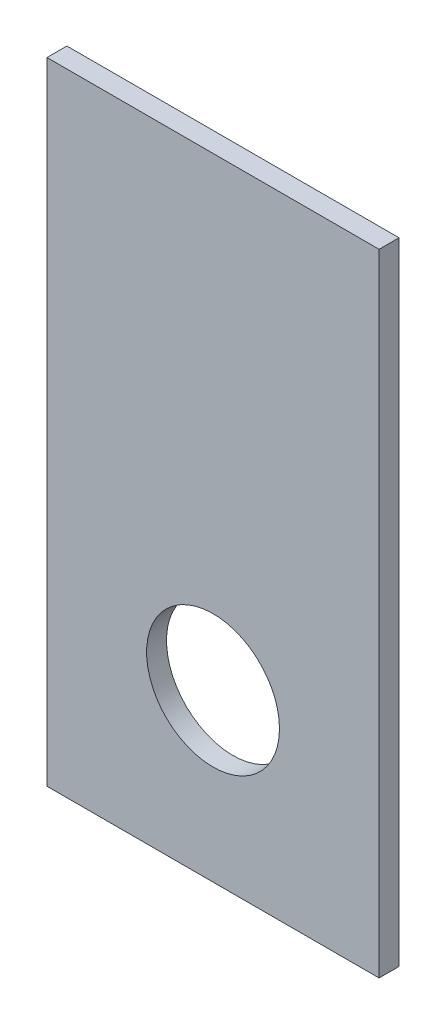
ISO-10303-21;
HEADER;
FILE_DESCRIPTION(('STEP AP214'),'2;1');
FILE_NAME('part.step','',(''),(''),'','','');
FILE_SCHEMA(('AUTOMOTIVE_DESIGN { 1 0 10303 214 1 1 1 1 }'));
ENDSEC;
DATA;
#1=APPLICATION_CONTEXT('core data for automotive mechanical design processes');
#2=APPLICATION_PROTOCOL_DEFINITION('international standard','automotive_design',2000,#1);
#3=PRODUCT_CONTEXT('',#1,'mechanical');
#4=PRODUCT('Part','Part','',(#3));
#5=PRODUCT_RELATED_PRODUCT_CATEGORY('part','',(#4));
#6=PRODUCT_DEFINITION_FORMATION('','',#4);
#7=PRODUCT_DEFINITION_CONTEXT('part definition',#1,'design');
#8=PRODUCT_DEFINITION('design','',#6,#7);
#9=PRODUCT_DEFINITION_SHAPE('','',#8);
#10=(LENGTH_UNIT() NAMED_UNIT(*) SI_UNIT(.MILLI.,.METRE.));
#11=(NAMED_UNIT(*) PLANE_ANGLE_UNIT() SI_UNIT($,.RADIAN.));
#12=(NAMED_UNIT(*) SI_UNIT($,.STERADIAN.) SOLID_ANGLE_UNIT());
#13=UNCERTAINTY_MEASURE_WITH_UNIT(LENGTH_MEASURE(1.E-05),#10,'distance_accuracy_value','');
#14=(GEOMETRIC_REPRESENTATION_CONTEXT(3) GLOBAL_UNCERTAINTY_ASSIGNED_CONTEXT((#13)) GLOBAL_UNIT_ASSIGNED_CONTEXT((#10,
#11,#12)) REPRESENTATION_CONTEXT('',''));
#15=CARTESIAN_POINT('',(0.,0.,0.));
#16=DIRECTION('',(0.,0.,1.));
#17=DIRECTION('',(1.,0.,0.));
#18=AXIS2_PLACEMENT_3D('',#15,#16,#17);
#19=CARTESIAN_POINT('',(0.,0.,3.));
#20=DIRECTION('',(0.,0.,1.));
#21=DIRECTION('',(1.,0.,0.));
#22=AXIS2_PLACEMENT_3D('',#19,#20,#21);
#23=PLANE('',#22);
#24=DIRECTION('',(0.,-1.,0.));
#25=VECTOR('',#24,1.);
#26=CARTESIAN_POINT('',(-25.,95.,3.));
#27=LINE('',#26,#25);
#28=CARTESIAN_POINT('',(-25.,95.,3.));
#29=VERTEX_POINT('',#28);
#30=CARTESIAN_POINT('',(-25.,0.,3.));
#31=VERTEX_POINT('',#30);
#32=EDGE_CURVE('E92',#29,#31,#27,.T.);
#33=ORIENTED_EDGE('',*,*,#32,.T.);
#34=DIRECTION('',(1.,0.,0.));
#35=VECTOR('',#34,1.);
#36=CARTESIAN_POINT('',(-25.,0.,3.));
#37=LINE('',#36,#35);
#38=CARTESIAN_POINT('',(25.,0.,3.));
#39=VERTEX_POINT('',#38);
#40=EDGE_CURVE('E87',#31,#39,#37,.T.);
#41=ORIENTED_EDGE('',*,*,#40,.T.);
#42=DIRECTION('',(0.,1.,0.));
#43=VECTOR('',#42,1.);
#44=CARTESIAN_POINT('',(25.,95.,3.));
#45=LINE('',#44,#43);
#46=CARTESIAN_POINT('',(25.,95.,3.));
#47=VERTEX_POINT('',#46);
#48=EDGE_CURVE('E90',#39,#47,#45,.T.);
#49=ORIENTED_EDGE('',*,*,#48,.T.);
#50=DIRECTION('',(-1.,0.,0.));
#51=VECTOR('',#50,1.);
#52=CARTESIAN_POINT('',(-25.,95.,3.));
#53=LINE('',#52,#51);
#54=EDGE_CURVE('E57',#47,#29,#53,.T.);
#55=ORIENTED_EDGE('',*,*,#54,.T.);
#56=EDGE_LOOP('',(#33,#41,#49,#55));
#57=FACE_BOUND('',#56,.T.);
#58=CARTESIAN_POINT('',(0.,25.,3.));
#59=DIRECTION('',(0.,0.,1.));
#60=DIRECTION('',(1.,0.,0.));
#61=AXIS2_PLACEMENT_3D('',#58,#59,#60);
#62=CIRCLE('',#61,10.);
#63=CARTESIAN_POINT('',(10.,25.,3.));
#64=VERTEX_POINT('',#63);
#65=EDGE_CURVE('E112',#64,#64,#62,.T.);
#66=ORIENTED_EDGE('',*,*,#65,.F.);
#67=EDGE_LOOP('',(#66));
#68=FACE_BOUND('',#67,.T.);
#69=ADVANCED_FACE('F39',(#57,#68),#23,.T.);
#70=CARTESIAN_POINT('',(0.,0.,0.));
#71=DIRECTION('',(0.,0.,1.));
#72=DIRECTION('',(1.,0.,0.));
#73=AXIS2_PLACEMENT_3D('',#70,#71,#72);
#74=PLANE('',#73);
#75=DIRECTION('',(0.,-1.,0.));
#76=VECTOR('',#75,1.);
#77=CARTESIAN_POINT('',(-25.,95.,0.));
#78=LINE('',#77,#76);
#79=CARTESIAN_POINT('',(-25.,95.,0.));
#80=VERTEX_POINT('',#79);
#81=CARTESIAN_POINT('',(-25.,0.,0.));
#82=VERTEX_POINT('',#81);
#83=EDGE_CURVE('E108',#80,#82,#78,.T.);
#84=ORIENTED_EDGE('',*,*,#83,.F.);
#85=DIRECTION('',(-1.,0.,0.));
#86=VECTOR('',#85,1.);
#87=CARTESIAN_POINT('',(-25.,95.,0.));
#88=LINE('',#87,#86);
#89=CARTESIAN_POINT('',(25.,95.,0.));
#90=VERTEX_POINT('',#89);
#91=EDGE_CURVE('E80',#90,#80,#88,.T.);
#92=ORIENTED_EDGE('',*,*,#91,.F.);
#93=DIRECTION('',(0.,1.,0.));
#94=VECTOR('',#93,1.);
#95=CARTESIAN_POINT('',(25.,95.,0.));
#96=LINE('',#95,#94);
#97=CARTESIAN_POINT('',(25.,0.,0.));
#98=VERTEX_POINT('',#97);
#99=EDGE_CURVE('E74',#98,#90,#96,.T.);
#100=ORIENTED_EDGE('',*,*,#99,.F.);
#101=DIRECTION('',(1.,0.,0.));
#102=VECTOR('',#101,1.);
#103=CARTESIAN_POINT('',(-25.,0.,0.));
#104=LINE('',#103,#102);
#105=EDGE_CURVE('E97',#82,#98,#104,.T.);
#106=ORIENTED_EDGE('',*,*,#105,.F.);
#107=EDGE_LOOP('',(#84,#92,#100,#106));
#108=FACE_BOUND('',#107,.T.);
#109=CARTESIAN_POINT('',(0.,25.,0.));
#110=DIRECTION('',(0.,0.,1.));
#111=DIRECTION('',(1.,0.,0.));
#112=AXIS2_PLACEMENT_3D('',#109,#110,#111);
#113=CIRCLE('',#112,10.);
#114=CARTESIAN_POINT('',(10.,25.,0.));
#115=VERTEX_POINT('',#114);
#116=EDGE_CURVE('E130',#115,#115,#113,.T.);
#117=ORIENTED_EDGE('',*,*,#116,.T.);
#118=EDGE_LOOP('',(#117));
#119=FACE_BOUND('',#118,.T.);
#120=ADVANCED_FACE('F125',(#108,#119),#74,.F.);
#121=CARTESIAN_POINT('',(-25.,95.,3.));
#122=DIRECTION('',(1.,0.,0.));
#123=DIRECTION('',(0.,1.,0.));
#124=AXIS2_PLACEMENT_3D('',#121,#122,#123);
#125=PLANE('',#124);
#126=ORIENTED_EDGE('',*,*,#83,.T.);
#127=DIRECTION('',(0.,0.,-1.));
#128=VECTOR('',#127,1.);
#129=CARTESIAN_POINT('',(-25.,0.,3.));
#130=LINE('',#129,#128);
#131=EDGE_CURVE('E11',#31,#82,#130,.T.);
#132=ORIENTED_EDGE('',*,*,#131,.F.);
#133=ORIENTED_EDGE('',*,*,#32,.F.);
#134=DIRECTION('',(0.,0.,-1.));
#135=VECTOR('',#134,1.);
#136=CARTESIAN_POINT('',(-25.,95.,3.));
#137=LINE('',#136,#135);
#138=EDGE_CURVE('E104',#29,#80,#137,.T.);
#139=ORIENTED_EDGE('',*,*,#138,.T.);
#140=EDGE_LOOP('',(#126,#132,#133,#139));
#141=FACE_BOUND('',#140,.T.);
#142=ADVANCED_FACE('F41',(#141),#125,.F.);
#143=CARTESIAN_POINT('',(-25.,0.,3.));
#144=DIRECTION('',(0.,1.,0.));
#145=DIRECTION('',(-1.,0.,0.));
#146=AXIS2_PLACEMENT_3D('',#143,#144,#145);
#147=PLANE('',#146);
#148=ORIENTED_EDGE('',*,*,#105,.T.);
#149=DIRECTION('',(0.,0.,-1.));
#150=VECTOR('',#149,1.);
#151=CARTESIAN_POINT('',(25.,0.,3.));
#152=LINE('',#151,#150);
#153=EDGE_CURVE('E49',#39,#98,#152,.T.);
#154=ORIENTED_EDGE('',*,*,#153,.F.);
#155=ORIENTED_EDGE('',*,*,#40,.F.);
#156=ORIENTED_EDGE('',*,*,#131,.T.);
#157=EDGE_LOOP('',(#148,#154,#155,#156));
#158=FACE_BOUND('',#157,.T.);
#159=ADVANCED_FACE('F96',(#158),#147,.F.);
#160=CARTESIAN_POINT('',(25.,95.,3.));
#161=DIRECTION('',(-1.,0.,0.));
#162=DIRECTION('',(0.,-1.,0.));
#163=AXIS2_PLACEMENT_3D('',#160,#161,#162);
#164=PLANE('',#163);
#165=ORIENTED_EDGE('',*,*,#99,.T.);
#166=DIRECTION('',(0.,0.,-1.));
#167=VECTOR('',#166,1.);
#168=CARTESIAN_POINT('',(25.,95.,3.));
#169=LINE('',#168,#167);
#170=EDGE_CURVE('E99',#47,#90,#169,.T.);
#171=ORIENTED_EDGE('',*,*,#170,.F.);
#172=ORIENTED_EDGE('',*,*,#48,.F.);
#173=ORIENTED_EDGE('',*,*,#153,.T.);
#174=EDGE_LOOP('',(#165,#171,#172,#173));
#175=FACE_BOUND('',#174,.T.);
#176=ADVANCED_FACE('F100',(#175),#164,.F.);
#177=CARTESIAN_POINT('',(-25.,95.,3.));
#178=DIRECTION('',(0.,-1.,0.));
#179=DIRECTION('',(1.,0.,0.));
#180=AXIS2_PLACEMENT_3D('',#177,#178,#179);
#181=PLANE('',#180);
#182=ORIENTED_EDGE('',*,*,#91,.T.);
#183=ORIENTED_EDGE('',*,*,#138,.F.);
#184=ORIENTED_EDGE('',*,*,#54,.F.);
#185=ORIENTED_EDGE('',*,*,#170,.T.);
#186=EDGE_LOOP('',(#182,#183,#184,#185));
#187=FACE_BOUND('',#186,.T.);
#188=ADVANCED_FACE('F122',(#187),#181,.F.);
#189=CARTESIAN_POINT('',(0.,25.,3.));
#190=DIRECTION('',(0.,0.,-1.));
#191=DIRECTION('',(-1.,0.,0.));
#192=AXIS2_PLACEMENT_3D('',#189,#190,#191);
#193=CYLINDRICAL_SURFACE('',#192,10.);
#194=ORIENTED_EDGE('',*,*,#65,.T.);
#195=EDGE_LOOP('',(#194));
#196=FACE_BOUND('',#195,.T.);
#197=ORIENTED_EDGE('',*,*,#116,.F.);
#198=EDGE_LOOP('',(#197));
#199=FACE_BOUND('',#198,.T.);
#200=ADVANCED_FACE('F138',(#196,#199),#193,.F.);
#201=CLOSED_SHELL('',(#69,#120,#142,#159,#176,#188,#200));
#202=MANIFOLD_SOLID_BREP('B2',#201);
#203=ADVANCED_BREP_SHAPE_REPRESENTATION('',(#18,#202),#14);
#204=SHAPE_DEFINITION_REPRESENTATION(#9,#203);
ENDSEC;
END-ISO-10303-21;
